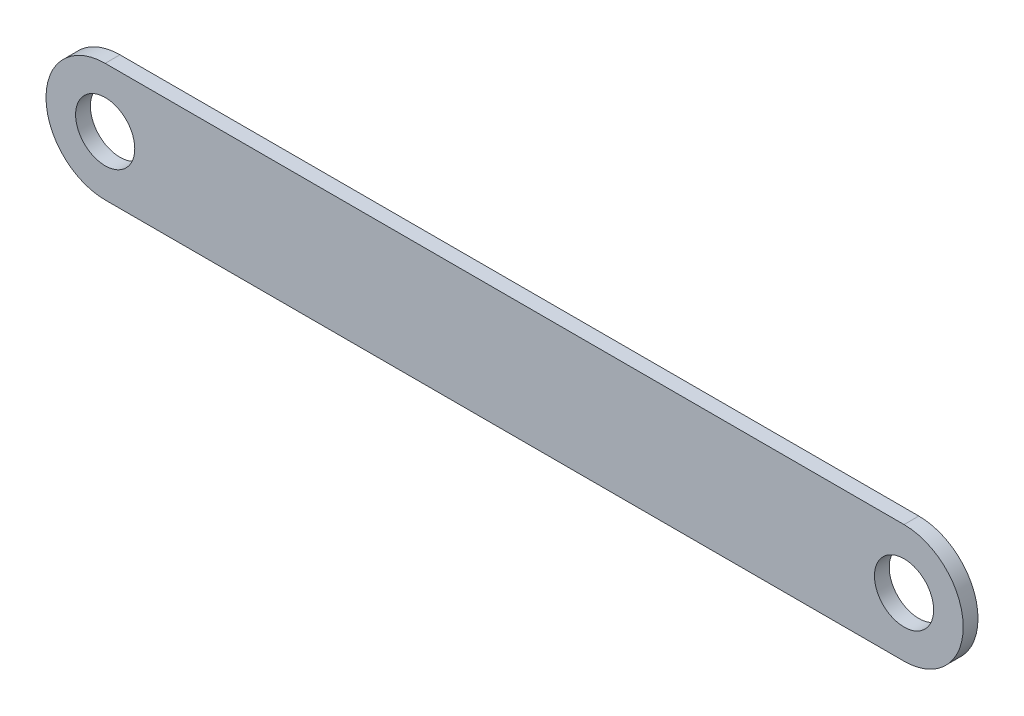
ISO-10303-21;
HEADER;
FILE_DESCRIPTION(('STEP AP214'),'2;1');
FILE_NAME('part.step','',(''),(''),'','','');
FILE_SCHEMA(('AUTOMOTIVE_DESIGN { 1 0 10303 214 1 1 1 1 }'));
ENDSEC;
DATA;
#1=APPLICATION_CONTEXT('core data for automotive mechanical design processes');
#2=APPLICATION_PROTOCOL_DEFINITION('international standard','automotive_design',2000,#1);
#3=PRODUCT_CONTEXT('',#1,'mechanical');
#4=PRODUCT('Part','Part','',(#3));
#5=PRODUCT_RELATED_PRODUCT_CATEGORY('part','',(#4));
#6=PRODUCT_DEFINITION_FORMATION('','',#4);
#7=PRODUCT_DEFINITION_CONTEXT('part definition',#1,'design');
#8=PRODUCT_DEFINITION('design','',#6,#7);
#9=PRODUCT_DEFINITION_SHAPE('','',#8);
#10=(LENGTH_UNIT() NAMED_UNIT(*) SI_UNIT(.MILLI.,.METRE.));
#11=(NAMED_UNIT(*) PLANE_ANGLE_UNIT() SI_UNIT($,.RADIAN.));
#12=(NAMED_UNIT(*) SI_UNIT($,.STERADIAN.) SOLID_ANGLE_UNIT());
#13=UNCERTAINTY_MEASURE_WITH_UNIT(LENGTH_MEASURE(1.E-05),#10,'distance_accuracy_value','');
#14=(GEOMETRIC_REPRESENTATION_CONTEXT(3) GLOBAL_UNCERTAINTY_ASSIGNED_CONTEXT((#13)) GLOBAL_UNIT_ASSIGNED_CONTEXT((#10,
#11,#12)) REPRESENTATION_CONTEXT('',''));
#15=CARTESIAN_POINT('',(0.,0.,0.));
#16=DIRECTION('',(0.,0.,1.));
#17=DIRECTION('',(1.,0.,0.));
#18=AXIS2_PLACEMENT_3D('',#15,#16,#17);
#19=CARTESIAN_POINT('',(51.5130500758725,1.55705614567526,5.));
#20=DIRECTION('',(0.,0.,-1.));
#21=DIRECTION('',(-1.,0.,0.));
#22=AXIS2_PLACEMENT_3D('',#19,#20,#21);
#23=CYLINDRICAL_SURFACE('',#22,20.);
#24=CARTESIAN_POINT('',(51.5130500758725,1.55705614567526,0.));
#25=DIRECTION('',(0.,0.,1.));
#26=DIRECTION('',(1.,0.,0.));
#27=AXIS2_PLACEMENT_3D('',#24,#25,#26);
#28=CIRCLE('',#27,20.);
#29=CARTESIAN_POINT('',(51.5130500758725,-18.4429438543247,0.));
#30=VERTEX_POINT('',#29);
#31=CARTESIAN_POINT('',(51.5130500758725,21.5570561456753,0.));
#32=VERTEX_POINT('',#31);
#33=EDGE_CURVE('E97',#30,#32,#28,.T.);
#34=ORIENTED_EDGE('',*,*,#33,.T.);
#35=DIRECTION('',(0.,0.,-1.));
#36=VECTOR('',#35,1.);
#37=CARTESIAN_POINT('',(51.5130500758725,21.5570561456753,5.));
#38=LINE('',#37,#36);
#39=CARTESIAN_POINT('',(51.5130500758725,21.5570561456753,5.));
#40=VERTEX_POINT('',#39);
#41=EDGE_CURVE('E11',#40,#32,#38,.T.);
#42=ORIENTED_EDGE('',*,*,#41,.F.);
#43=CARTESIAN_POINT('',(51.5130500758725,1.55705614567526,5.));
#44=DIRECTION('',(0.,0.,1.));
#45=DIRECTION('',(1.,0.,0.));
#46=AXIS2_PLACEMENT_3D('',#43,#44,#45);
#47=CIRCLE('',#46,20.);
#48=CARTESIAN_POINT('',(51.5130500758725,-18.4429438543247,5.));
#49=VERTEX_POINT('',#48);
#50=EDGE_CURVE('E85',#49,#40,#47,.T.);
#51=ORIENTED_EDGE('',*,*,#50,.F.);
#52=DIRECTION('',(0.,0.,-1.));
#53=VECTOR('',#52,1.);
#54=CARTESIAN_POINT('',(51.5130500758725,-18.4429438543247,5.));
#55=LINE('',#54,#53);
#56=EDGE_CURVE('E93',#49,#30,#55,.T.);
#57=ORIENTED_EDGE('',*,*,#56,.T.);
#58=EDGE_LOOP('',(#34,#42,#51,#57));
#59=FACE_BOUND('',#58,.T.);
#60=ADVANCED_FACE('F34',(#59),#23,.T.);
#61=CARTESIAN_POINT('',(51.5130500758725,21.5570561456753,5.));
#62=DIRECTION('',(0.,-1.,0.));
#63=DIRECTION('',(1.,0.,0.));
#64=AXIS2_PLACEMENT_3D('',#61,#62,#63);
#65=PLANE('',#64);
#66=DIRECTION('',(-1.,0.,0.));
#67=VECTOR('',#66,1.);
#68=CARTESIAN_POINT('',(51.5130500758725,21.5570561456753,0.));
#69=LINE('',#68,#67);
#70=CARTESIAN_POINT('',(-218.486949924127,21.5570561456752,0.));
#71=VERTEX_POINT('',#70);
#72=EDGE_CURVE('E89',#32,#71,#69,.T.);
#73=ORIENTED_EDGE('',*,*,#72,.T.);
#74=DIRECTION('',(0.,0.,-1.));
#75=VECTOR('',#74,1.);
#76=CARTESIAN_POINT('',(-218.486949924127,21.5570561456752,5.));
#77=LINE('',#76,#75);
#78=CARTESIAN_POINT('',(-218.486949924127,21.5570561456752,5.));
#79=VERTEX_POINT('',#78);
#80=EDGE_CURVE('E42',#79,#71,#77,.T.);
#81=ORIENTED_EDGE('',*,*,#80,.F.);
#82=DIRECTION('',(-1.,0.,0.));
#83=VECTOR('',#82,1.);
#84=CARTESIAN_POINT('',(51.5130500758725,21.5570561456753,5.));
#85=LINE('',#84,#83);
#86=EDGE_CURVE('E80',#40,#79,#85,.T.);
#87=ORIENTED_EDGE('',*,*,#86,.F.);
#88=ORIENTED_EDGE('',*,*,#41,.T.);
#89=EDGE_LOOP('',(#73,#81,#87,#88));
#90=FACE_BOUND('',#89,.T.);
#91=ADVANCED_FACE('F88',(#90),#65,.F.);
#92=CARTESIAN_POINT('',(-218.486949924127,1.55705614567524,5.));
#93=DIRECTION('',(0.,0.,-1.));
#94=DIRECTION('',(-1.,0.,0.));
#95=AXIS2_PLACEMENT_3D('',#92,#93,#94);
#96=CYLINDRICAL_SURFACE('',#95,20.);
#97=CARTESIAN_POINT('',(-218.486949924127,1.55705614567524,0.));
#98=DIRECTION('',(0.,0.,1.));
#99=DIRECTION('',(1.,0.,0.));
#100=AXIS2_PLACEMENT_3D('',#97,#98,#99);
#101=CIRCLE('',#100,20.);
#102=CARTESIAN_POINT('',(-218.486949924127,-18.4429438543247,0.));
#103=VERTEX_POINT('',#102);
#104=EDGE_CURVE('E67',#71,#103,#101,.T.);
#105=ORIENTED_EDGE('',*,*,#104,.T.);
#106=DIRECTION('',(0.,0.,-1.));
#107=VECTOR('',#106,1.);
#108=CARTESIAN_POINT('',(-218.486949924127,-18.4429438543247,5.));
#109=LINE('',#108,#107);
#110=CARTESIAN_POINT('',(-218.486949924127,-18.4429438543247,5.));
#111=VERTEX_POINT('',#110);
#112=EDGE_CURVE('E90',#111,#103,#109,.T.);
#113=ORIENTED_EDGE('',*,*,#112,.F.);
#114=CARTESIAN_POINT('',(-218.486949924127,1.55705614567524,5.));
#115=DIRECTION('',(0.,0.,1.));
#116=DIRECTION('',(1.,0.,0.));
#117=AXIS2_PLACEMENT_3D('',#114,#115,#116);
#118=CIRCLE('',#117,20.);
#119=EDGE_CURVE('E83',#79,#111,#118,.T.);
#120=ORIENTED_EDGE('',*,*,#119,.F.);
#121=ORIENTED_EDGE('',*,*,#80,.T.);
#122=EDGE_LOOP('',(#105,#113,#120,#121));
#123=FACE_BOUND('',#122,.T.);
#124=ADVANCED_FACE('F91',(#123),#96,.T.);
#125=CARTESIAN_POINT('',(-218.486949924127,-18.4429438543247,5.));
#126=DIRECTION('',(0.,1.,0.));
#127=DIRECTION('',(0.,0.,1.));
#128=AXIS2_PLACEMENT_3D('',#125,#126,#127);
#129=PLANE('',#128);
#130=DIRECTION('',(1.,0.,0.));
#131=VECTOR('',#130,1.);
#132=CARTESIAN_POINT('',(-218.486949924127,-18.4429438543247,0.));
#133=LINE('',#132,#131);
#134=EDGE_CURVE('E73',#103,#30,#133,.T.);
#135=ORIENTED_EDGE('',*,*,#134,.T.);
#136=ORIENTED_EDGE('',*,*,#56,.F.);
#137=DIRECTION('',(1.,0.,0.));
#138=VECTOR('',#137,1.);
#139=CARTESIAN_POINT('',(-218.486949924127,-18.4429438543247,5.));
#140=LINE('',#139,#138);
#141=EDGE_CURVE('E50',#111,#49,#140,.T.);
#142=ORIENTED_EDGE('',*,*,#141,.F.);
#143=ORIENTED_EDGE('',*,*,#112,.T.);
#144=EDGE_LOOP('',(#135,#136,#142,#143));
#145=FACE_BOUND('',#144,.T.);
#146=ADVANCED_FACE('F105',(#145),#129,.F.);
#147=CARTESIAN_POINT('',(51.5130500758725,1.55705614567526,5.));
#148=DIRECTION('',(0.,0.,1.));
#149=DIRECTION('',(1.,0.,0.));
#150=AXIS2_PLACEMENT_3D('',#147,#148,#149);
#151=PLANE('',#150);
#152=CARTESIAN_POINT('',(51.5130500758725,1.55705614567526,5.));
#153=DIRECTION('',(0.,0.,1.));
#154=DIRECTION('',(1.,0.,0.));
#155=AXIS2_PLACEMENT_3D('',#152,#153,#154);
#156=CIRCLE('',#155,10.);
#157=CARTESIAN_POINT('',(61.5130500758725,1.55705614567526,5.));
#158=VERTEX_POINT('',#157);
#159=EDGE_CURVE('E117',#158,#158,#156,.T.);
#160=ORIENTED_EDGE('',*,*,#159,.F.);
#161=EDGE_LOOP('',(#160));
#162=FACE_BOUND('',#161,.T.);
#163=CARTESIAN_POINT('',(-218.486949924127,1.55705614567524,5.));
#164=DIRECTION('',(0.,0.,1.));
#165=DIRECTION('',(1.,0.,0.));
#166=AXIS2_PLACEMENT_3D('',#163,#164,#165);
#167=CIRCLE('',#166,10.);
#168=CARTESIAN_POINT('',(-208.486949924127,1.55705614567524,5.));
#169=VERTEX_POINT('',#168);
#170=EDGE_CURVE('E111',#169,#169,#167,.T.);
#171=ORIENTED_EDGE('',*,*,#170,.F.);
#172=EDGE_LOOP('',(#171));
#173=FACE_BOUND('',#172,.T.);
#174=ORIENTED_EDGE('',*,*,#50,.T.);
#175=ORIENTED_EDGE('',*,*,#86,.T.);
#176=ORIENTED_EDGE('',*,*,#119,.T.);
#177=ORIENTED_EDGE('',*,*,#141,.T.);
#178=EDGE_LOOP('',(#174,#175,#176,#177));
#179=FACE_BOUND('',#178,.T.);
#180=ADVANCED_FACE('F81',(#162,#173,#179),#151,.T.);
#181=CARTESIAN_POINT('',(51.5130500758725,1.55705614567526,0.));
#182=DIRECTION('',(0.,0.,1.));
#183=DIRECTION('',(1.,0.,0.));
#184=AXIS2_PLACEMENT_3D('',#181,#182,#183);
#185=PLANE('',#184);
#186=CARTESIAN_POINT('',(51.5130500758725,1.55705614567526,0.));
#187=DIRECTION('',(0.,0.,1.));
#188=DIRECTION('',(1.,0.,0.));
#189=AXIS2_PLACEMENT_3D('',#186,#187,#188);
#190=CIRCLE('',#189,10.);
#191=CARTESIAN_POINT('',(61.5130500758725,1.55705614567526,0.));
#192=VERTEX_POINT('',#191);
#193=EDGE_CURVE('E114',#192,#192,#190,.T.);
#194=ORIENTED_EDGE('',*,*,#193,.T.);
#195=EDGE_LOOP('',(#194));
#196=FACE_BOUND('',#195,.T.);
#197=CARTESIAN_POINT('',(-218.486949924127,1.55705614567524,0.));
#198=DIRECTION('',(0.,0.,1.));
#199=DIRECTION('',(1.,0.,0.));
#200=AXIS2_PLACEMENT_3D('',#197,#198,#199);
#201=CIRCLE('',#200,10.);
#202=CARTESIAN_POINT('',(-208.486949924127,1.55705614567524,0.));
#203=VERTEX_POINT('',#202);
#204=EDGE_CURVE('E100',#203,#203,#201,.T.);
#205=ORIENTED_EDGE('',*,*,#204,.T.);
#206=EDGE_LOOP('',(#205));
#207=FACE_BOUND('',#206,.T.);
#208=ORIENTED_EDGE('',*,*,#33,.F.);
#209=ORIENTED_EDGE('',*,*,#134,.F.);
#210=ORIENTED_EDGE('',*,*,#104,.F.);
#211=ORIENTED_EDGE('',*,*,#72,.F.);
#212=EDGE_LOOP('',(#208,#209,#210,#211));
#213=FACE_BOUND('',#212,.T.);
#214=ADVANCED_FACE('F108',(#196,#207,#213),#185,.F.);
#215=CARTESIAN_POINT('',(-218.486949924127,1.55705614567524,0.));
#216=DIRECTION('',(0.,0.,1.));
#217=DIRECTION('',(1.,0.,0.));
#218=AXIS2_PLACEMENT_3D('',#215,#216,#217);
#219=CYLINDRICAL_SURFACE('',#218,10.);
#220=ORIENTED_EDGE('',*,*,#204,.F.);
#221=EDGE_LOOP('',(#220));
#222=FACE_BOUND('',#221,.T.);
#223=ORIENTED_EDGE('',*,*,#170,.T.);
#224=EDGE_LOOP('',(#223));
#225=FACE_BOUND('',#224,.T.);
#226=ADVANCED_FACE('F128',(#222,#225),#219,.F.);
#227=CARTESIAN_POINT('',(51.5130500758725,1.55705614567526,0.));
#228=DIRECTION('',(0.,0.,1.));
#229=DIRECTION('',(1.,0.,0.));
#230=AXIS2_PLACEMENT_3D('',#227,#228,#229);
#231=CYLINDRICAL_SURFACE('',#230,10.);
#232=ORIENTED_EDGE('',*,*,#193,.F.);
#233=EDGE_LOOP('',(#232));
#234=FACE_BOUND('',#233,.T.);
#235=ORIENTED_EDGE('',*,*,#159,.T.);
#236=EDGE_LOOP('',(#235));
#237=FACE_BOUND('',#236,.T.);
#238=ADVANCED_FACE('F125',(#234,#237),#231,.F.);
#239=CLOSED_SHELL('',(#60,#91,#124,#146,#180,#214,#226,#238));
#240=MANIFOLD_SOLID_BREP('B2',#239);
#241=ADVANCED_BREP_SHAPE_REPRESENTATION('',(#18,#240),#14);
#242=SHAPE_DEFINITION_REPRESENTATION(#9,#241);
ENDSEC;
END-ISO-10303-21;
